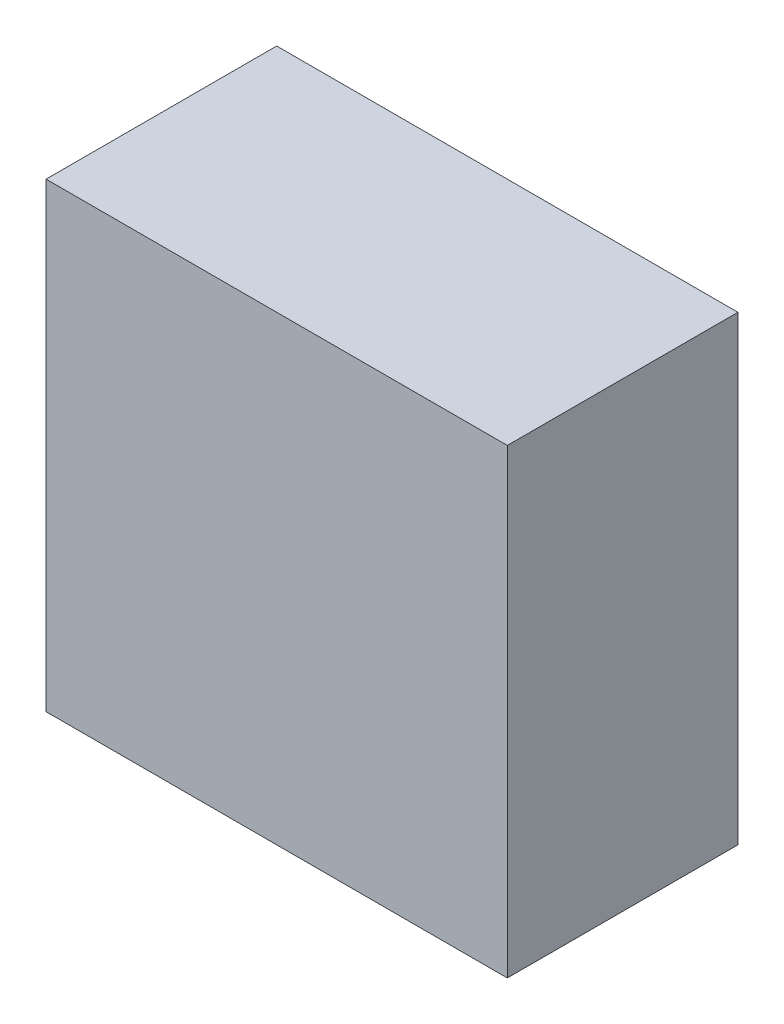
ISO-10303-21;
HEADER;
FILE_DESCRIPTION(('STEP AP214'),'2;1');
FILE_NAME('part.step','',(''),(''),'','','');
FILE_SCHEMA(('AUTOMOTIVE_DESIGN { 1 0 10303 214 1 1 1 1 }'));
ENDSEC;
DATA;
#1=APPLICATION_CONTEXT('core data for automotive mechanical design processes');
#2=APPLICATION_PROTOCOL_DEFINITION('international standard','automotive_design',2000,#1);
#3=PRODUCT_CONTEXT('',#1,'mechanical');
#4=PRODUCT('Part','Part','',(#3));
#5=PRODUCT_RELATED_PRODUCT_CATEGORY('part','',(#4));
#6=PRODUCT_DEFINITION_FORMATION('','',#4);
#7=PRODUCT_DEFINITION_CONTEXT('part definition',#1,'design');
#8=PRODUCT_DEFINITION('design','',#6,#7);
#9=PRODUCT_DEFINITION_SHAPE('','',#8);
#10=(LENGTH_UNIT() NAMED_UNIT(*) SI_UNIT(.MILLI.,.METRE.));
#11=(NAMED_UNIT(*) PLANE_ANGLE_UNIT() SI_UNIT($,.RADIAN.));
#12=(NAMED_UNIT(*) SI_UNIT($,.STERADIAN.) SOLID_ANGLE_UNIT());
#13=UNCERTAINTY_MEASURE_WITH_UNIT(LENGTH_MEASURE(1.E-05),#10,'distance_accuracy_value','');
#14=(GEOMETRIC_REPRESENTATION_CONTEXT(3) GLOBAL_UNCERTAINTY_ASSIGNED_CONTEXT((#13)) GLOBAL_UNIT_ASSIGNED_CONTEXT((#10,
#11,#12)) REPRESENTATION_CONTEXT('',''));
#15=CARTESIAN_POINT('',(0.,0.,0.));
#16=DIRECTION('',(0.,0.,1.));
#17=DIRECTION('',(1.,0.,0.));
#18=AXIS2_PLACEMENT_3D('',#15,#16,#17);
#19=CARTESIAN_POINT('',(0.,0.,2.75));
#20=DIRECTION('',(0.,0.,-1.));
#21=DIRECTION('',(-1.,0.,0.));
#22=AXIS2_PLACEMENT_3D('',#19,#20,#21);
#23=PLANE('',#22);
#24=DIRECTION('',(1.,0.,0.));
#25=VECTOR('',#24,1.);
#26=CARTESIAN_POINT('',(158.313158045852,-67.0708841556956,2.75));
#27=LINE('',#26,#25);
#28=CARTESIAN_POINT('',(158.313158045852,-67.0708841556956,2.75));
#29=VERTEX_POINT('',#28);
#30=CARTESIAN_POINT('',(154.313158045852,-67.0708841556956,2.75));
#31=VERTEX_POINT('',#30);
#32=EDGE_CURVE('E80',#29,#31,#27,.F.);
#33=ORIENTED_EDGE('',*,*,#32,.T.);
#34=DIRECTION('',(0.,1.,0.));
#35=VECTOR('',#34,1.);
#36=CARTESIAN_POINT('',(154.313158045852,-67.0708841556956,2.75));
#37=LINE('',#36,#35);
#38=CARTESIAN_POINT('',(154.313158045852,-71.0708841556957,2.75));
#39=VERTEX_POINT('',#38);
#40=EDGE_CURVE('E55',#31,#39,#37,.F.);
#41=ORIENTED_EDGE('',*,*,#40,.T.);
#42=DIRECTION('',(1.,0.,0.));
#43=VECTOR('',#42,1.);
#44=CARTESIAN_POINT('',(158.313158045852,-71.0708841556957,2.75));
#45=LINE('',#44,#43);
#46=CARTESIAN_POINT('',(158.313158045852,-71.0708841556957,2.75));
#47=VERTEX_POINT('',#46);
#48=EDGE_CURVE('E57',#39,#47,#45,.T.);
#49=ORIENTED_EDGE('',*,*,#48,.T.);
#50=DIRECTION('',(0.,1.,0.));
#51=VECTOR('',#50,1.);
#52=CARTESIAN_POINT('',(158.313158045852,-67.0708841556956,2.75));
#53=LINE('',#52,#51);
#54=EDGE_CURVE('E20',#47,#29,#53,.T.);
#55=ORIENTED_EDGE('',*,*,#54,.T.);
#56=EDGE_LOOP('',(#33,#41,#49,#55));
#57=FACE_BOUND('',#56,.T.);
#58=ADVANCED_FACE('F17',(#57),#23,.F.);
#59=CARTESIAN_POINT('',(158.313158045852,-67.0708841556956,2.75));
#60=DIRECTION('',(-1.,0.,0.));
#61=DIRECTION('',(0.,0.,1.));
#62=AXIS2_PLACEMENT_3D('',#59,#60,#61);
#63=PLANE('',#62);
#64=DIRECTION('',(0.,0.,-1.));
#65=VECTOR('',#64,1.);
#66=CARTESIAN_POINT('',(158.313158045852,-67.0708841556956,2.75));
#67=LINE('',#66,#65);
#68=CARTESIAN_POINT('',(158.313158045852,-67.0708841556956,0.75));
#69=VERTEX_POINT('',#68);
#70=EDGE_CURVE('E68',#69,#29,#67,.F.);
#71=ORIENTED_EDGE('',*,*,#70,.T.);
#72=ORIENTED_EDGE('',*,*,#54,.F.);
#73=DIRECTION('',(0.,0.,1.));
#74=VECTOR('',#73,1.);
#75=CARTESIAN_POINT('',(158.313158045852,-71.0708841556957,2.75));
#76=LINE('',#75,#74);
#77=CARTESIAN_POINT('',(158.313158045852,-71.0708841556957,0.75));
#78=VERTEX_POINT('',#77);
#79=EDGE_CURVE('E63',#47,#78,#76,.F.);
#80=ORIENTED_EDGE('',*,*,#79,.T.);
#81=DIRECTION('',(0.,1.,0.));
#82=VECTOR('',#81,1.);
#83=CARTESIAN_POINT('',(158.313158045852,0.,0.75));
#84=LINE('',#83,#82);
#85=EDGE_CURVE('E83',#69,#78,#84,.F.);
#86=ORIENTED_EDGE('',*,*,#85,.F.);
#87=EDGE_LOOP('',(#71,#72,#80,#86));
#88=FACE_BOUND('',#87,.T.);
#89=ADVANCED_FACE('F65',(#88),#63,.F.);
#90=CARTESIAN_POINT('',(158.313158045852,-71.0708841556957,2.75));
#91=DIRECTION('',(0.,1.,0.));
#92=DIRECTION('',(0.,0.,1.));
#93=AXIS2_PLACEMENT_3D('',#90,#91,#92);
#94=PLANE('',#93);
#95=ORIENTED_EDGE('',*,*,#79,.F.);
#96=ORIENTED_EDGE('',*,*,#48,.F.);
#97=DIRECTION('',(0.,0.,-1.));
#98=VECTOR('',#97,1.);
#99=CARTESIAN_POINT('',(154.313158045852,-71.0708841556957,2.75));
#100=LINE('',#99,#98);
#101=CARTESIAN_POINT('',(154.313158045852,-71.0708841556957,0.75));
#102=VERTEX_POINT('',#101);
#103=EDGE_CURVE('E75',#39,#102,#100,.T.);
#104=ORIENTED_EDGE('',*,*,#103,.T.);
#105=DIRECTION('',(-1.,0.,0.));
#106=VECTOR('',#105,1.);
#107=CARTESIAN_POINT('',(0.,-71.0708841556957,0.75));
#108=LINE('',#107,#106);
#109=EDGE_CURVE('E72',#78,#102,#108,.T.);
#110=ORIENTED_EDGE('',*,*,#109,.F.);
#111=EDGE_LOOP('',(#95,#96,#104,#110));
#112=FACE_BOUND('',#111,.T.);
#113=ADVANCED_FACE('F70',(#112),#94,.F.);
#114=CARTESIAN_POINT('',(154.313158045852,-67.0708841556956,2.75));
#115=DIRECTION('',(1.,0.,0.));
#116=DIRECTION('',(0.,0.,-1.));
#117=AXIS2_PLACEMENT_3D('',#114,#115,#116);
#118=PLANE('',#117);
#119=ORIENTED_EDGE('',*,*,#103,.F.);
#120=ORIENTED_EDGE('',*,*,#40,.F.);
#121=DIRECTION('',(0.,0.,-1.));
#122=VECTOR('',#121,1.);
#123=CARTESIAN_POINT('',(154.313158045852,-67.0708841556956,2.75));
#124=LINE('',#123,#122);
#125=CARTESIAN_POINT('',(154.313158045852,-67.0708841556956,0.75));
#126=VERTEX_POINT('',#125);
#127=EDGE_CURVE('E35',#31,#126,#124,.T.);
#128=ORIENTED_EDGE('',*,*,#127,.T.);
#129=DIRECTION('',(0.,1.,0.));
#130=VECTOR('',#129,1.);
#131=CARTESIAN_POINT('',(154.313158045852,0.,0.75));
#132=LINE('',#131,#130);
#133=EDGE_CURVE('E26',#102,#126,#132,.T.);
#134=ORIENTED_EDGE('',*,*,#133,.F.);
#135=EDGE_LOOP('',(#119,#120,#128,#134));
#136=FACE_BOUND('',#135,.T.);
#137=ADVANCED_FACE('F89',(#136),#118,.F.);
#138=CARTESIAN_POINT('',(158.313158045852,-67.0708841556956,2.75));
#139=DIRECTION('',(0.,-1.,0.));
#140=DIRECTION('',(0.,0.,-1.));
#141=AXIS2_PLACEMENT_3D('',#138,#139,#140);
#142=PLANE('',#141);
#143=ORIENTED_EDGE('',*,*,#127,.F.);
#144=ORIENTED_EDGE('',*,*,#32,.F.);
#145=ORIENTED_EDGE('',*,*,#70,.F.);
#146=DIRECTION('',(-1.,0.,0.));
#147=VECTOR('',#146,1.);
#148=CARTESIAN_POINT('',(0.,-67.0708841556956,0.75));
#149=LINE('',#148,#147);
#150=EDGE_CURVE('E11',#126,#69,#149,.F.);
#151=ORIENTED_EDGE('',*,*,#150,.F.);
#152=EDGE_LOOP('',(#143,#144,#145,#151));
#153=FACE_BOUND('',#152,.T.);
#154=ADVANCED_FACE('F91',(#153),#142,.F.);
#155=CARTESIAN_POINT('',(0.,0.,0.75));
#156=DIRECTION('',(0.,0.,-1.));
#157=DIRECTION('',(-1.,0.,0.));
#158=AXIS2_PLACEMENT_3D('',#155,#156,#157);
#159=PLANE('',#158);
#160=ORIENTED_EDGE('',*,*,#133,.T.);
#161=ORIENTED_EDGE('',*,*,#150,.T.);
#162=ORIENTED_EDGE('',*,*,#85,.T.);
#163=ORIENTED_EDGE('',*,*,#109,.T.);
#164=EDGE_LOOP('',(#160,#161,#162,#163));
#165=FACE_BOUND('',#164,.T.);
#166=ADVANCED_FACE('F88',(#165),#159,.T.);
#167=CLOSED_SHELL('',(#58,#89,#113,#137,#154,#166));
#168=MANIFOLD_SOLID_BREP('B1',#167);
#169=ADVANCED_BREP_SHAPE_REPRESENTATION('',(#18,#168),#14);
#170=SHAPE_DEFINITION_REPRESENTATION(#9,#169);
ENDSEC;
END-ISO-10303-21;
